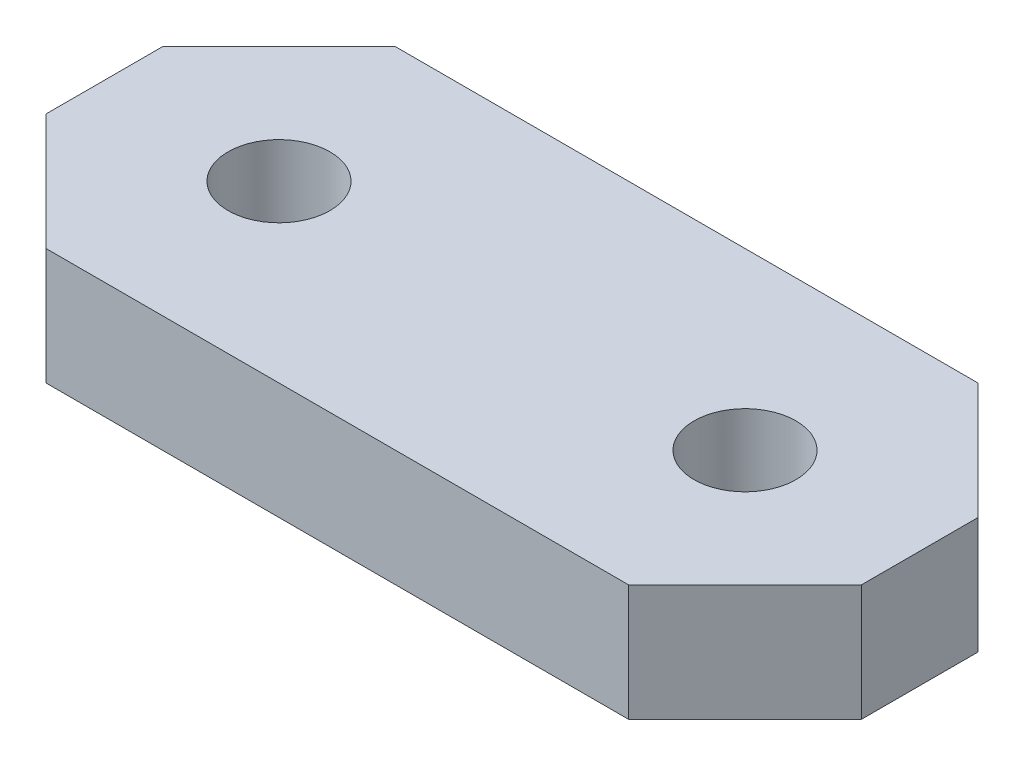
ISO-10303-21;
HEADER;
FILE_DESCRIPTION(('STEP AP214'),'2;1');
FILE_NAME('part.step','',(''),(''),'','','');
FILE_SCHEMA(('AUTOMOTIVE_DESIGN { 1 0 10303 214 1 1 1 1 }'));
ENDSEC;
DATA;
#1=APPLICATION_CONTEXT('core data for automotive mechanical design processes');
#2=APPLICATION_PROTOCOL_DEFINITION('international standard','automotive_design',2000,#1);
#3=PRODUCT_CONTEXT('',#1,'mechanical');
#4=PRODUCT('Part','Part','',(#3));
#5=PRODUCT_RELATED_PRODUCT_CATEGORY('part','',(#4));
#6=PRODUCT_DEFINITION_FORMATION('','',#4);
#7=PRODUCT_DEFINITION_CONTEXT('part definition',#1,'design');
#8=PRODUCT_DEFINITION('design','',#6,#7);
#9=PRODUCT_DEFINITION_SHAPE('','',#8);
#10=(LENGTH_UNIT() NAMED_UNIT(*) SI_UNIT(.MILLI.,.METRE.));
#11=(NAMED_UNIT(*) PLANE_ANGLE_UNIT() SI_UNIT($,.RADIAN.));
#12=(NAMED_UNIT(*) SI_UNIT($,.STERADIAN.) SOLID_ANGLE_UNIT());
#13=UNCERTAINTY_MEASURE_WITH_UNIT(LENGTH_MEASURE(1.E-05),#10,'distance_accuracy_value','');
#14=(GEOMETRIC_REPRESENTATION_CONTEXT(3) GLOBAL_UNCERTAINTY_ASSIGNED_CONTEXT((#13)) GLOBAL_UNIT_ASSIGNED_CONTEXT((#10,
#11,#12)) REPRESENTATION_CONTEXT('',''));
#15=CARTESIAN_POINT('',(0.,0.,0.));
#16=DIRECTION('',(0.,0.,1.));
#17=DIRECTION('',(1.,0.,0.));
#18=AXIS2_PLACEMENT_3D('',#15,#16,#17);
#19=CARTESIAN_POINT('',(0.,4.,12.));
#20=DIRECTION('',(1.,0.,0.));
#21=DIRECTION('',(0.,0.,-1.));
#22=AXIS2_PLACEMENT_3D('',#19,#20,#21);
#23=PLANE('',#22);
#24=DIRECTION('',(0.,0.,-1.));
#25=VECTOR('',#24,1.);
#26=CARTESIAN_POINT('',(0.,4.,12.));
#27=LINE('',#26,#25);
#28=CARTESIAN_POINT('',(0.,4.,7.99999999999999));
#29=VERTEX_POINT('',#28);
#30=CARTESIAN_POINT('',(0.,4.,4.));
#31=VERTEX_POINT('',#30);
#32=EDGE_CURVE('E162',#29,#31,#27,.T.);
#33=ORIENTED_EDGE('',*,*,#32,.T.);
#34=DIRECTION('',(0.,-1.,0.));
#35=VECTOR('',#34,1.);
#36=CARTESIAN_POINT('',(0.,4.,4.));
#37=LINE('',#36,#35);
#38=CARTESIAN_POINT('',(0.,0.,4.));
#39=VERTEX_POINT('',#38);
#40=EDGE_CURVE('E118',#31,#39,#37,.T.);
#41=ORIENTED_EDGE('',*,*,#40,.T.);
#42=DIRECTION('',(0.,0.,-1.));
#43=VECTOR('',#42,1.);
#44=CARTESIAN_POINT('',(0.,0.,12.));
#45=LINE('',#44,#43);
#46=CARTESIAN_POINT('',(0.,0.,7.99999999999999));
#47=VERTEX_POINT('',#46);
#48=EDGE_CURVE('E102',#47,#39,#45,.T.);
#49=ORIENTED_EDGE('',*,*,#48,.F.);
#50=DIRECTION('',(0.,1.,0.));
#51=VECTOR('',#50,1.);
#52=CARTESIAN_POINT('',(0.,4.,7.99999999999999));
#53=LINE('',#52,#51);
#54=EDGE_CURVE('E115',#47,#29,#53,.T.);
#55=ORIENTED_EDGE('',*,*,#54,.T.);
#56=EDGE_LOOP('',(#33,#41,#49,#55));
#57=FACE_BOUND('',#56,.T.);
#58=ADVANCED_FACE('F33',(#57),#23,.F.);
#59=CARTESIAN_POINT('',(16.,0.,12.));
#60=DIRECTION('',(0.,1.,0.));
#61=DIRECTION('',(0.,0.,1.));
#62=AXIS2_PLACEMENT_3D('',#59,#60,#61);
#63=PLANE('',#62);
#64=CARTESIAN_POINT('',(22.,0.,6.));
#65=DIRECTION('',(0.,1.,0.));
#66=DIRECTION('',(0.,0.,1.));
#67=AXIS2_PLACEMENT_3D('',#64,#65,#66);
#68=CIRCLE('',#67,1.75);
#69=CARTESIAN_POINT('',(22.,0.,7.75));
#70=VERTEX_POINT('',#69);
#71=EDGE_CURVE('E296',#70,#70,#68,.T.);
#72=ORIENTED_EDGE('',*,*,#71,.T.);
#73=EDGE_LOOP('',(#72));
#74=FACE_BOUND('',#73,.T.);
#75=CARTESIAN_POINT('',(6.,0.,6.));
#76=DIRECTION('',(0.,1.,0.));
#77=DIRECTION('',(0.,0.,1.));
#78=AXIS2_PLACEMENT_3D('',#75,#76,#77);
#79=CIRCLE('',#78,1.75);
#80=CARTESIAN_POINT('',(6.,0.,7.75));
#81=VERTEX_POINT('',#80);
#82=EDGE_CURVE('E171',#81,#81,#79,.T.);
#83=ORIENTED_EDGE('',*,*,#82,.T.);
#84=EDGE_LOOP('',(#83));
#85=FACE_BOUND('',#84,.T.);
#86=ORIENTED_EDGE('',*,*,#48,.T.);
#87=DIRECTION('',(-0.707106781186549,0.,0.707106781186546));
#88=VECTOR('',#87,1.);
#89=CARTESIAN_POINT('',(0.,0.,4.));
#90=LINE('',#89,#88);
#91=CARTESIAN_POINT('',(4.00000000000001,0.,0.));
#92=VERTEX_POINT('',#91);
#93=EDGE_CURVE('E109',#39,#92,#90,.F.);
#94=ORIENTED_EDGE('',*,*,#93,.T.);
#95=DIRECTION('',(1.,0.,0.));
#96=VECTOR('',#95,1.);
#97=CARTESIAN_POINT('',(16.,0.,0.));
#98=LINE('',#97,#96);
#99=CARTESIAN_POINT('',(24.,0.,0.));
#100=VERTEX_POINT('',#99);
#101=EDGE_CURVE('E169',#92,#100,#98,.T.);
#102=ORIENTED_EDGE('',*,*,#101,.T.);
#103=DIRECTION('',(-0.707106781186549,0.,-0.707106781186546));
#104=VECTOR('',#103,1.);
#105=CARTESIAN_POINT('',(28.,0.,4.));
#106=LINE('',#105,#104);
#107=CARTESIAN_POINT('',(28.,0.,4.));
#108=VERTEX_POINT('',#107);
#109=EDGE_CURVE('E110',#100,#108,#106,.F.);
#110=ORIENTED_EDGE('',*,*,#109,.T.);
#111=DIRECTION('',(0.,0.,-1.));
#112=VECTOR('',#111,1.);
#113=CARTESIAN_POINT('',(28.,0.,12.));
#114=LINE('',#113,#112);
#115=CARTESIAN_POINT('',(28.,0.,7.99999999999999));
#116=VERTEX_POINT('',#115);
#117=EDGE_CURVE('E119',#116,#108,#114,.T.);
#118=ORIENTED_EDGE('',*,*,#117,.F.);
#119=DIRECTION('',(-0.707106781186546,0.,0.707106781186549));
#120=VECTOR('',#119,1.);
#121=CARTESIAN_POINT('',(24.,0.,12.));
#122=LINE('',#121,#120);
#123=CARTESIAN_POINT('',(24.,0.,12.));
#124=VERTEX_POINT('',#123);
#125=EDGE_CURVE('E125',#116,#124,#122,.T.);
#126=ORIENTED_EDGE('',*,*,#125,.T.);
#127=DIRECTION('',(1.,0.,0.));
#128=VECTOR('',#127,1.);
#129=CARTESIAN_POINT('',(0.,0.,12.));
#130=LINE('',#129,#128);
#131=CARTESIAN_POINT('',(4.,0.,12.));
#132=VERTEX_POINT('',#131);
#133=EDGE_CURVE('E104',#132,#124,#130,.T.);
#134=ORIENTED_EDGE('',*,*,#133,.F.);
#135=DIRECTION('',(-0.707106781186546,0.,-0.707106781186549));
#136=VECTOR('',#135,1.);
#137=CARTESIAN_POINT('',(4.,0.,12.));
#138=LINE('',#137,#136);
#139=EDGE_CURVE('E99',#132,#47,#138,.T.);
#140=ORIENTED_EDGE('',*,*,#139,.T.);
#141=EDGE_LOOP('',(#86,#94,#102,#110,#118,#126,#134,#140));
#142=FACE_BOUND('',#141,.T.);
#143=ADVANCED_FACE('F101',(#74,#85,#142),#63,.F.);
#144=CARTESIAN_POINT('',(28.,0.,12.));
#145=DIRECTION('',(-1.,0.,0.));
#146=DIRECTION('',(0.,0.,1.));
#147=AXIS2_PLACEMENT_3D('',#144,#145,#146);
#148=PLANE('',#147);
#149=ORIENTED_EDGE('',*,*,#117,.T.);
#150=DIRECTION('',(0.,1.,0.));
#151=VECTOR('',#150,1.);
#152=CARTESIAN_POINT('',(28.,0.,4.));
#153=LINE('',#152,#151);
#154=CARTESIAN_POINT('',(28.,4.,4.));
#155=VERTEX_POINT('',#154);
#156=EDGE_CURVE('E11',#108,#155,#153,.T.);
#157=ORIENTED_EDGE('',*,*,#156,.T.);
#158=DIRECTION('',(0.,0.,-1.));
#159=VECTOR('',#158,1.);
#160=CARTESIAN_POINT('',(28.,4.,12.));
#161=LINE('',#160,#159);
#162=CARTESIAN_POINT('',(28.,4.,7.99999999999999));
#163=VERTEX_POINT('',#162);
#164=EDGE_CURVE('E150',#163,#155,#161,.T.);
#165=ORIENTED_EDGE('',*,*,#164,.F.);
#166=DIRECTION('',(0.,-1.,0.));
#167=VECTOR('',#166,1.);
#168=CARTESIAN_POINT('',(28.,0.,7.99999999999999));
#169=LINE('',#168,#167);
#170=EDGE_CURVE('E41',#163,#116,#169,.T.);
#171=ORIENTED_EDGE('',*,*,#170,.T.);
#172=EDGE_LOOP('',(#149,#157,#165,#171));
#173=FACE_BOUND('',#172,.T.);
#174=ADVANCED_FACE('F149',(#173),#148,.F.);
#175=CARTESIAN_POINT('',(28.,4.,12.));
#176=DIRECTION('',(0.,-1.,0.));
#177=DIRECTION('',(1.,0.,0.));
#178=AXIS2_PLACEMENT_3D('',#175,#176,#177);
#179=PLANE('',#178);
#180=CARTESIAN_POINT('',(22.,4.,6.));
#181=DIRECTION('',(0.,-1.,0.));
#182=DIRECTION('',(0.,0.,-1.));
#183=AXIS2_PLACEMENT_3D('',#180,#181,#182);
#184=CIRCLE('',#183,1.75);
#185=CARTESIAN_POINT('',(22.,4.,4.25));
#186=VERTEX_POINT('',#185);
#187=EDGE_CURVE('E292',#186,#186,#184,.T.);
#188=ORIENTED_EDGE('',*,*,#187,.T.);
#189=EDGE_LOOP('',(#188));
#190=FACE_BOUND('',#189,.T.);
#191=CARTESIAN_POINT('',(6.,4.,6.));
#192=DIRECTION('',(0.,-1.,0.));
#193=DIRECTION('',(0.,0.,-1.));
#194=AXIS2_PLACEMENT_3D('',#191,#192,#193);
#195=CIRCLE('',#194,1.75);
#196=CARTESIAN_POINT('',(6.,4.,4.25));
#197=VERTEX_POINT('',#196);
#198=EDGE_CURVE('E295',#197,#197,#195,.T.);
#199=ORIENTED_EDGE('',*,*,#198,.T.);
#200=EDGE_LOOP('',(#199));
#201=FACE_BOUND('',#200,.T.);
#202=DIRECTION('',(-1.,0.,0.));
#203=VECTOR('',#202,1.);
#204=CARTESIAN_POINT('',(28.,4.,0.));
#205=LINE('',#204,#203);
#206=CARTESIAN_POINT('',(24.,4.,0.));
#207=VERTEX_POINT('',#206);
#208=CARTESIAN_POINT('',(4.00000000000001,4.,0.));
#209=VERTEX_POINT('',#208);
#210=EDGE_CURVE('E165',#207,#209,#205,.T.);
#211=ORIENTED_EDGE('',*,*,#210,.T.);
#212=DIRECTION('',(0.707106781186549,0.,-0.707106781186546));
#213=VECTOR('',#212,1.);
#214=CARTESIAN_POINT('',(0.,4.,4.));
#215=LINE('',#214,#213);
#216=EDGE_CURVE('E139',#209,#31,#215,.F.);
#217=ORIENTED_EDGE('',*,*,#216,.T.);
#218=ORIENTED_EDGE('',*,*,#32,.F.);
#219=DIRECTION('',(0.707106781186546,0.,0.707106781186549));
#220=VECTOR('',#219,1.);
#221=CARTESIAN_POINT('',(4.,4.,12.));
#222=LINE('',#221,#220);
#223=CARTESIAN_POINT('',(4.,4.,12.));
#224=VERTEX_POINT('',#223);
#225=EDGE_CURVE('E123',#29,#224,#222,.T.);
#226=ORIENTED_EDGE('',*,*,#225,.T.);
#227=DIRECTION('',(-1.,0.,0.));
#228=VECTOR('',#227,1.);
#229=CARTESIAN_POINT('',(28.,4.,12.));
#230=LINE('',#229,#228);
#231=CARTESIAN_POINT('',(24.,4.,12.));
#232=VERTEX_POINT('',#231);
#233=EDGE_CURVE('E159',#232,#224,#230,.T.);
#234=ORIENTED_EDGE('',*,*,#233,.F.);
#235=DIRECTION('',(0.707106781186546,0.,-0.707106781186549));
#236=VECTOR('',#235,1.);
#237=CARTESIAN_POINT('',(24.,4.,12.));
#238=LINE('',#237,#236);
#239=EDGE_CURVE('E55',#232,#163,#238,.T.);
#240=ORIENTED_EDGE('',*,*,#239,.T.);
#241=ORIENTED_EDGE('',*,*,#164,.T.);
#242=DIRECTION('',(0.707106781186549,0.,0.707106781186546));
#243=VECTOR('',#242,1.);
#244=CARTESIAN_POINT('',(28.,4.,4.));
#245=LINE('',#244,#243);
#246=EDGE_CURVE('E48',#155,#207,#245,.F.);
#247=ORIENTED_EDGE('',*,*,#246,.T.);
#248=EDGE_LOOP('',(#211,#217,#218,#226,#234,#240,#241,#247));
#249=FACE_BOUND('',#248,.T.);
#250=ADVANCED_FACE('F161',(#190,#201,#249),#179,.F.);
#251=CARTESIAN_POINT('',(0.,0.,12.));
#252=DIRECTION('',(0.,0.,1.));
#253=DIRECTION('',(1.,0.,0.));
#254=AXIS2_PLACEMENT_3D('',#251,#252,#253);
#255=PLANE('',#254);
#256=ORIENTED_EDGE('',*,*,#233,.T.);
#257=DIRECTION('',(0.,-1.,0.));
#258=VECTOR('',#257,1.);
#259=CARTESIAN_POINT('',(4.,0.,12.));
#260=LINE('',#259,#258);
#261=EDGE_CURVE('E144',#224,#132,#260,.T.);
#262=ORIENTED_EDGE('',*,*,#261,.T.);
#263=ORIENTED_EDGE('',*,*,#133,.T.);
#264=DIRECTION('',(0.,1.,0.));
#265=VECTOR('',#264,1.);
#266=CARTESIAN_POINT('',(24.,4.,12.));
#267=LINE('',#266,#265);
#268=EDGE_CURVE('E141',#124,#232,#267,.T.);
#269=ORIENTED_EDGE('',*,*,#268,.T.);
#270=EDGE_LOOP('',(#256,#262,#263,#269));
#271=FACE_BOUND('',#270,.T.);
#272=ADVANCED_FACE('F158',(#271),#255,.T.);
#273=CARTESIAN_POINT('',(0.,0.,0.));
#274=DIRECTION('',(0.,0.,1.));
#275=DIRECTION('',(1.,0.,0.));
#276=AXIS2_PLACEMENT_3D('',#273,#274,#275);
#277=PLANE('',#276);
#278=ORIENTED_EDGE('',*,*,#101,.F.);
#279=DIRECTION('',(0.,1.,0.));
#280=VECTOR('',#279,1.);
#281=CARTESIAN_POINT('',(4.00000000000001,0.,0.));
#282=LINE('',#281,#280);
#283=EDGE_CURVE('E134',#92,#209,#282,.T.);
#284=ORIENTED_EDGE('',*,*,#283,.T.);
#285=ORIENTED_EDGE('',*,*,#210,.F.);
#286=DIRECTION('',(0.,-1.,0.));
#287=VECTOR('',#286,1.);
#288=CARTESIAN_POINT('',(24.,0.,0.));
#289=LINE('',#288,#287);
#290=EDGE_CURVE('E132',#207,#100,#289,.T.);
#291=ORIENTED_EDGE('',*,*,#290,.T.);
#292=EDGE_LOOP('',(#278,#284,#285,#291));
#293=FACE_BOUND('',#292,.T.);
#294=ADVANCED_FACE('F177',(#293),#277,.F.);
#295=CARTESIAN_POINT('',(6.,4.,6.));
#296=DIRECTION('',(0.,-1.,0.));
#297=DIRECTION('',(0.,0.,-1.));
#298=AXIS2_PLACEMENT_3D('',#295,#296,#297);
#299=CYLINDRICAL_SURFACE('',#298,1.75);
#300=ORIENTED_EDGE('',*,*,#198,.F.);
#301=EDGE_LOOP('',(#300));
#302=FACE_BOUND('',#301,.T.);
#303=ORIENTED_EDGE('',*,*,#82,.F.);
#304=EDGE_LOOP('',(#303));
#305=FACE_BOUND('',#304,.T.);
#306=ADVANCED_FACE('F202',(#302,#305),#299,.F.);
#307=CARTESIAN_POINT('',(22.,4.,6.));
#308=DIRECTION('',(0.,-1.,0.));
#309=DIRECTION('',(0.,0.,-1.));
#310=AXIS2_PLACEMENT_3D('',#307,#308,#309);
#311=CYLINDRICAL_SURFACE('',#310,1.75);
#312=ORIENTED_EDGE('',*,*,#187,.F.);
#313=EDGE_LOOP('',(#312));
#314=FACE_BOUND('',#313,.T.);
#315=ORIENTED_EDGE('',*,*,#71,.F.);
#316=EDGE_LOOP('',(#315));
#317=FACE_BOUND('',#316,.T.);
#318=ADVANCED_FACE('F197',(#314,#317),#311,.F.);
#319=CARTESIAN_POINT('',(0.,4.,4.));
#320=DIRECTION('',(0.707106781186546,0.,0.707106781186549));
#321=DIRECTION('',(0.,-1.,0.));
#322=AXIS2_PLACEMENT_3D('',#319,#320,#321);
#323=PLANE('',#322);
#324=ORIENTED_EDGE('',*,*,#216,.F.);
#325=ORIENTED_EDGE('',*,*,#283,.F.);
#326=ORIENTED_EDGE('',*,*,#93,.F.);
#327=ORIENTED_EDGE('',*,*,#40,.F.);
#328=EDGE_LOOP('',(#324,#325,#326,#327));
#329=FACE_BOUND('',#328,.T.);
#330=ADVANCED_FACE('F185',(#329),#323,.F.);
#331=CARTESIAN_POINT('',(4.,0.,12.));
#332=DIRECTION('',(-0.707106781186549,0.,0.707106781186546));
#333=DIRECTION('',(0.,1.,0.));
#334=AXIS2_PLACEMENT_3D('',#331,#332,#333);
#335=PLANE('',#334);
#336=ORIENTED_EDGE('',*,*,#225,.F.);
#337=ORIENTED_EDGE('',*,*,#54,.F.);
#338=ORIENTED_EDGE('',*,*,#139,.F.);
#339=ORIENTED_EDGE('',*,*,#261,.F.);
#340=EDGE_LOOP('',(#336,#337,#338,#339));
#341=FACE_BOUND('',#340,.T.);
#342=ADVANCED_FACE('F122',(#341),#335,.T.);
#343=CARTESIAN_POINT('',(28.,0.,4.));
#344=DIRECTION('',(-0.707106781186546,0.,0.707106781186549));
#345=DIRECTION('',(0.,1.,0.));
#346=AXIS2_PLACEMENT_3D('',#343,#344,#345);
#347=PLANE('',#346);
#348=ORIENTED_EDGE('',*,*,#109,.F.);
#349=ORIENTED_EDGE('',*,*,#290,.F.);
#350=ORIENTED_EDGE('',*,*,#246,.F.);
#351=ORIENTED_EDGE('',*,*,#156,.F.);
#352=EDGE_LOOP('',(#348,#349,#350,#351));
#353=FACE_BOUND('',#352,.T.);
#354=ADVANCED_FACE('F179',(#353),#347,.F.);
#355=CARTESIAN_POINT('',(24.,0.,12.));
#356=DIRECTION('',(0.707106781186549,0.,0.707106781186546));
#357=DIRECTION('',(0.,-1.,0.));
#358=AXIS2_PLACEMENT_3D('',#355,#356,#357);
#359=PLANE('',#358);
#360=ORIENTED_EDGE('',*,*,#125,.F.);
#361=ORIENTED_EDGE('',*,*,#170,.F.);
#362=ORIENTED_EDGE('',*,*,#239,.F.);
#363=ORIENTED_EDGE('',*,*,#268,.F.);
#364=EDGE_LOOP('',(#360,#361,#362,#363));
#365=FACE_BOUND('',#364,.T.);
#366=ADVANCED_FACE('F35',(#365),#359,.T.);
#367=CLOSED_SHELL('',(#58,#143,#174,#250,#272,#294,#306,#318,#330,#342,#354,#366));
#368=MANIFOLD_SOLID_BREP('B2',#367);
#369=ADVANCED_BREP_SHAPE_REPRESENTATION('',(#18,#368),#14);
#370=SHAPE_DEFINITION_REPRESENTATION(#9,#369);
ENDSEC;
END-ISO-10303-21;
